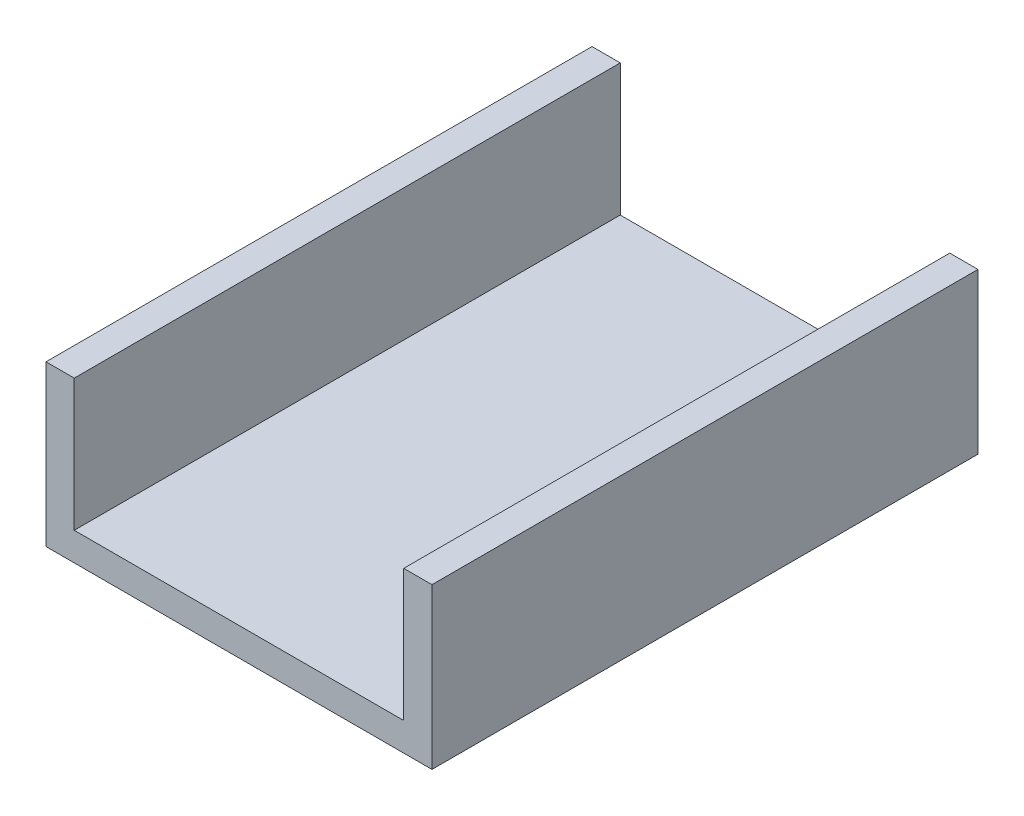
ISO-10303-21;
HEADER;
FILE_DESCRIPTION(('STEP AP214'),'2;1');
FILE_NAME('part.step','',(''),(''),'','','');
FILE_SCHEMA(('AUTOMOTIVE_DESIGN { 1 0 10303 214 1 1 1 1 }'));
ENDSEC;
DATA;
#1=APPLICATION_CONTEXT('core data for automotive mechanical design processes');
#2=APPLICATION_PROTOCOL_DEFINITION('international standard','automotive_design',2000,#1);
#3=PRODUCT_CONTEXT('',#1,'mechanical');
#4=PRODUCT('Part','Part','',(#3));
#5=PRODUCT_RELATED_PRODUCT_CATEGORY('part','',(#4));
#6=PRODUCT_DEFINITION_FORMATION('','',#4);
#7=PRODUCT_DEFINITION_CONTEXT('part definition',#1,'design');
#8=PRODUCT_DEFINITION('design','',#6,#7);
#9=PRODUCT_DEFINITION_SHAPE('','',#8);
#10=(LENGTH_UNIT() NAMED_UNIT(*) SI_UNIT(.MILLI.,.METRE.));
#11=(NAMED_UNIT(*) PLANE_ANGLE_UNIT() SI_UNIT($,.RADIAN.));
#12=(NAMED_UNIT(*) SI_UNIT($,.STERADIAN.) SOLID_ANGLE_UNIT());
#13=UNCERTAINTY_MEASURE_WITH_UNIT(LENGTH_MEASURE(1.E-05),#10,'distance_accuracy_value','');
#14=(GEOMETRIC_REPRESENTATION_CONTEXT(3) GLOBAL_UNCERTAINTY_ASSIGNED_CONTEXT((#13)) GLOBAL_UNIT_ASSIGNED_CONTEXT((#10,
#11,#12)) REPRESENTATION_CONTEXT('',''));
#15=CARTESIAN_POINT('',(0.,0.,0.));
#16=DIRECTION('',(0.,0.,1.));
#17=DIRECTION('',(1.,0.,0.));
#18=AXIS2_PLACEMENT_3D('',#15,#16,#17);
#19=CARTESIAN_POINT('',(0.,0.,580.));
#20=DIRECTION('',(-1.,0.,0.));
#21=DIRECTION('',(0.,0.,1.));
#22=AXIS2_PLACEMENT_3D('',#19,#20,#21);
#23=PLANE('',#22);
#24=DIRECTION('',(0.,1.,0.));
#25=VECTOR('',#24,1.);
#26=CARTESIAN_POINT('',(0.,0.,0.));
#27=LINE('',#26,#25);
#28=CARTESIAN_POINT('',(0.,30.,0.));
#29=VERTEX_POINT('',#28);
#30=CARTESIAN_POINT('',(0.,170.,0.));
#31=VERTEX_POINT('',#30);
#32=EDGE_CURVE('E132',#29,#31,#27,.T.);
#33=ORIENTED_EDGE('',*,*,#32,.T.);
#34=DIRECTION('',(0.,0.,-1.));
#35=VECTOR('',#34,1.);
#36=CARTESIAN_POINT('',(0.,170.,580.));
#37=LINE('',#36,#35);
#38=CARTESIAN_POINT('',(0.,170.,580.));
#39=VERTEX_POINT('',#38);
#40=EDGE_CURVE('E11',#39,#31,#37,.T.);
#41=ORIENTED_EDGE('',*,*,#40,.F.);
#42=DIRECTION('',(0.,1.,0.));
#43=VECTOR('',#42,1.);
#44=CARTESIAN_POINT('',(0.,0.,580.));
#45=LINE('',#44,#43);
#46=CARTESIAN_POINT('',(0.,30.,580.));
#47=VERTEX_POINT('',#46);
#48=EDGE_CURVE('E152',#47,#39,#45,.T.);
#49=ORIENTED_EDGE('',*,*,#48,.F.);
#50=DIRECTION('',(0.,0.,-1.));
#51=VECTOR('',#50,1.);
#52=CARTESIAN_POINT('',(0.,30.,580.));
#53=LINE('',#52,#51);
#54=EDGE_CURVE('E51',#47,#29,#53,.T.);
#55=ORIENTED_EDGE('',*,*,#54,.T.);
#56=EDGE_LOOP('',(#33,#41,#49,#55));
#57=FACE_BOUND('',#56,.T.);
#58=ADVANCED_FACE('F35',(#57),#23,.F.);
#59=CARTESIAN_POINT('',(-1.57281595155231E-13,170.,580.));
#60=DIRECTION('',(0.,-1.,0.));
#61=DIRECTION('',(1.,0.,0.));
#62=AXIS2_PLACEMENT_3D('',#59,#60,#61);
#63=PLANE('',#62);
#64=DIRECTION('',(-1.,0.,0.));
#65=VECTOR('',#64,1.);
#66=CARTESIAN_POINT('',(-1.57281595155231E-13,170.,0.));
#67=LINE('',#66,#65);
#68=CARTESIAN_POINT('',(-30.,170.,0.));
#69=VERTEX_POINT('',#68);
#70=EDGE_CURVE('E134',#31,#69,#67,.T.);
#71=ORIENTED_EDGE('',*,*,#70,.T.);
#72=DIRECTION('',(0.,0.,-1.));
#73=VECTOR('',#72,1.);
#74=CARTESIAN_POINT('',(-30.,170.,580.));
#75=LINE('',#74,#73);
#76=CARTESIAN_POINT('',(-30.,170.,580.));
#77=VERTEX_POINT('',#76);
#78=EDGE_CURVE('E43',#77,#69,#75,.T.);
#79=ORIENTED_EDGE('',*,*,#78,.F.);
#80=DIRECTION('',(-1.,0.,0.));
#81=VECTOR('',#80,1.);
#82=CARTESIAN_POINT('',(-1.57281595155231E-13,170.,580.));
#83=LINE('',#82,#81);
#84=EDGE_CURVE('E89',#39,#77,#83,.T.);
#85=ORIENTED_EDGE('',*,*,#84,.F.);
#86=ORIENTED_EDGE('',*,*,#40,.T.);
#87=EDGE_LOOP('',(#71,#79,#85,#86));
#88=FACE_BOUND('',#87,.T.);
#89=ADVANCED_FACE('F165',(#88),#63,.F.);
#90=CARTESIAN_POINT('',(-30.,0.,580.));
#91=DIRECTION('',(-1.,0.,0.));
#92=DIRECTION('',(0.,0.,1.));
#93=AXIS2_PLACEMENT_3D('',#90,#91,#92);
#94=PLANE('',#93);
#95=DIRECTION('',(0.,1.,0.));
#96=VECTOR('',#95,1.);
#97=CARTESIAN_POINT('',(-30.,0.,0.));
#98=LINE('',#97,#96);
#99=CARTESIAN_POINT('',(-30.,0.,0.));
#100=VERTEX_POINT('',#99);
#101=EDGE_CURVE('E137',#100,#69,#98,.T.);
#102=ORIENTED_EDGE('',*,*,#101,.F.);
#103=DIRECTION('',(0.,0.,-1.));
#104=VECTOR('',#103,1.);
#105=CARTESIAN_POINT('',(-30.,0.,580.));
#106=LINE('',#105,#104);
#107=CARTESIAN_POINT('',(-30.,0.,580.));
#108=VERTEX_POINT('',#107);
#109=EDGE_CURVE('E158',#108,#100,#106,.T.);
#110=ORIENTED_EDGE('',*,*,#109,.F.);
#111=DIRECTION('',(0.,1.,0.));
#112=VECTOR('',#111,1.);
#113=CARTESIAN_POINT('',(-30.,0.,580.));
#114=LINE('',#113,#112);
#115=EDGE_CURVE('E164',#108,#77,#114,.T.);
#116=ORIENTED_EDGE('',*,*,#115,.T.);
#117=ORIENTED_EDGE('',*,*,#78,.T.);
#118=EDGE_LOOP('',(#102,#110,#116,#117));
#119=FACE_BOUND('',#118,.T.);
#120=ADVANCED_FACE('F162',(#119),#94,.T.);
#121=CARTESIAN_POINT('',(0.,0.,580.));
#122=DIRECTION('',(0.,-1.,0.));
#123=DIRECTION('',(0.,0.,-1.));
#124=AXIS2_PLACEMENT_3D('',#121,#122,#123);
#125=PLANE('',#124);
#126=DIRECTION('',(-1.,0.,0.));
#127=VECTOR('',#126,1.);
#128=CARTESIAN_POINT('',(0.,0.,0.));
#129=LINE('',#128,#127);
#130=CARTESIAN_POINT('',(380.,0.,0.));
#131=VERTEX_POINT('',#130);
#132=EDGE_CURVE('E140',#131,#100,#129,.T.);
#133=ORIENTED_EDGE('',*,*,#132,.F.);
#134=DIRECTION('',(0.,0.,-1.));
#135=VECTOR('',#134,1.);
#136=CARTESIAN_POINT('',(380.,0.,580.));
#137=LINE('',#136,#135);
#138=CARTESIAN_POINT('',(380.,0.,580.));
#139=VERTEX_POINT('',#138);
#140=EDGE_CURVE('E156',#139,#131,#137,.T.);
#141=ORIENTED_EDGE('',*,*,#140,.F.);
#142=DIRECTION('',(-1.,0.,0.));
#143=VECTOR('',#142,1.);
#144=CARTESIAN_POINT('',(0.,0.,580.));
#145=LINE('',#144,#143);
#146=EDGE_CURVE('E174',#139,#108,#145,.T.);
#147=ORIENTED_EDGE('',*,*,#146,.T.);
#148=ORIENTED_EDGE('',*,*,#109,.T.);
#149=EDGE_LOOP('',(#133,#141,#147,#148));
#150=FACE_BOUND('',#149,.T.);
#151=ADVANCED_FACE('F172',(#150),#125,.T.);
#152=CARTESIAN_POINT('',(380.,0.,580.));
#153=DIRECTION('',(-1.,0.,0.));
#154=DIRECTION('',(0.,0.,1.));
#155=AXIS2_PLACEMENT_3D('',#152,#153,#154);
#156=PLANE('',#155);
#157=DIRECTION('',(0.,1.,0.));
#158=VECTOR('',#157,1.);
#159=CARTESIAN_POINT('',(380.,0.,0.));
#160=LINE('',#159,#158);
#161=CARTESIAN_POINT('',(380.,170.,0.));
#162=VERTEX_POINT('',#161);
#163=EDGE_CURVE('E143',#131,#162,#160,.T.);
#164=ORIENTED_EDGE('',*,*,#163,.T.);
#165=DIRECTION('',(0.,0.,-1.));
#166=VECTOR('',#165,1.);
#167=CARTESIAN_POINT('',(380.,170.,580.));
#168=LINE('',#167,#166);
#169=CARTESIAN_POINT('',(380.,170.,580.));
#170=VERTEX_POINT('',#169);
#171=EDGE_CURVE('E114',#170,#162,#168,.T.);
#172=ORIENTED_EDGE('',*,*,#171,.F.);
#173=DIRECTION('',(0.,1.,0.));
#174=VECTOR('',#173,1.);
#175=CARTESIAN_POINT('',(380.,0.,580.));
#176=LINE('',#175,#174);
#177=EDGE_CURVE('E123',#139,#170,#176,.T.);
#178=ORIENTED_EDGE('',*,*,#177,.F.);
#179=ORIENTED_EDGE('',*,*,#140,.T.);
#180=EDGE_LOOP('',(#164,#172,#178,#179));
#181=FACE_BOUND('',#180,.T.);
#182=ADVANCED_FACE('F200',(#181),#156,.F.);
#183=CARTESIAN_POINT('',(0.,170.,580.));
#184=DIRECTION('',(0.,1.,0.));
#185=DIRECTION('',(0.,0.,1.));
#186=AXIS2_PLACEMENT_3D('',#183,#184,#185);
#187=PLANE('',#186);
#188=DIRECTION('',(1.,0.,0.));
#189=VECTOR('',#188,1.);
#190=CARTESIAN_POINT('',(0.,170.,0.));
#191=LINE('',#190,#189);
#192=CARTESIAN_POINT('',(350.,170.,0.));
#193=VERTEX_POINT('',#192);
#194=EDGE_CURVE('E110',#193,#162,#191,.T.);
#195=ORIENTED_EDGE('',*,*,#194,.F.);
#196=DIRECTION('',(0.,0.,-1.));
#197=VECTOR('',#196,1.);
#198=CARTESIAN_POINT('',(350.,170.,580.));
#199=LINE('',#198,#197);
#200=CARTESIAN_POINT('',(350.,170.,580.));
#201=VERTEX_POINT('',#200);
#202=EDGE_CURVE('E105',#201,#193,#199,.T.);
#203=ORIENTED_EDGE('',*,*,#202,.F.);
#204=DIRECTION('',(1.,0.,0.));
#205=VECTOR('',#204,1.);
#206=CARTESIAN_POINT('',(0.,170.,580.));
#207=LINE('',#206,#205);
#208=EDGE_CURVE('E108',#201,#170,#207,.T.);
#209=ORIENTED_EDGE('',*,*,#208,.T.);
#210=ORIENTED_EDGE('',*,*,#171,.T.);
#211=EDGE_LOOP('',(#195,#203,#209,#210));
#212=FACE_BOUND('',#211,.T.);
#213=ADVANCED_FACE('F107',(#212),#187,.T.);
#214=CARTESIAN_POINT('',(350.,0.,580.));
#215=DIRECTION('',(-1.,0.,0.));
#216=DIRECTION('',(0.,0.,1.));
#217=AXIS2_PLACEMENT_3D('',#214,#215,#216);
#218=PLANE('',#217);
#219=DIRECTION('',(0.,1.,0.));
#220=VECTOR('',#219,1.);
#221=CARTESIAN_POINT('',(350.,0.,0.));
#222=LINE('',#221,#220);
#223=CARTESIAN_POINT('',(350.,30.,0.));
#224=VERTEX_POINT('',#223);
#225=EDGE_CURVE('E147',#224,#193,#222,.T.);
#226=ORIENTED_EDGE('',*,*,#225,.F.);
#227=DIRECTION('',(0.,0.,-1.));
#228=VECTOR('',#227,1.);
#229=CARTESIAN_POINT('',(350.,30.,580.));
#230=LINE('',#229,#228);
#231=CARTESIAN_POINT('',(350.,30.,580.));
#232=VERTEX_POINT('',#231);
#233=EDGE_CURVE('E77',#232,#224,#230,.T.);
#234=ORIENTED_EDGE('',*,*,#233,.F.);
#235=DIRECTION('',(0.,1.,0.));
#236=VECTOR('',#235,1.);
#237=CARTESIAN_POINT('',(350.,0.,580.));
#238=LINE('',#237,#236);
#239=EDGE_CURVE('E120',#232,#201,#238,.T.);
#240=ORIENTED_EDGE('',*,*,#239,.T.);
#241=ORIENTED_EDGE('',*,*,#202,.T.);
#242=EDGE_LOOP('',(#226,#234,#240,#241));
#243=FACE_BOUND('',#242,.T.);
#244=ADVANCED_FACE('F126',(#243),#218,.T.);
#245=CARTESIAN_POINT('',(0.,30.,580.));
#246=DIRECTION('',(0.,1.,0.));
#247=DIRECTION('',(0.,0.,1.));
#248=AXIS2_PLACEMENT_3D('',#245,#246,#247);
#249=PLANE('',#248);
#250=DIRECTION('',(1.,0.,0.));
#251=VECTOR('',#250,1.);
#252=CARTESIAN_POINT('',(0.,30.,0.));
#253=LINE('',#252,#251);
#254=EDGE_CURVE('E149',#29,#224,#253,.T.);
#255=ORIENTED_EDGE('',*,*,#254,.F.);
#256=ORIENTED_EDGE('',*,*,#54,.F.);
#257=DIRECTION('',(1.,0.,0.));
#258=VECTOR('',#257,1.);
#259=CARTESIAN_POINT('',(0.,30.,580.));
#260=LINE('',#259,#258);
#261=EDGE_CURVE('E127',#47,#232,#260,.T.);
#262=ORIENTED_EDGE('',*,*,#261,.T.);
#263=ORIENTED_EDGE('',*,*,#233,.T.);
#264=EDGE_LOOP('',(#255,#256,#262,#263));
#265=FACE_BOUND('',#264,.T.);
#266=ADVANCED_FACE('F179',(#265),#249,.T.);
#267=CARTESIAN_POINT('',(0.,0.,580.));
#268=DIRECTION('',(0.,0.,1.));
#269=DIRECTION('',(1.,0.,0.));
#270=AXIS2_PLACEMENT_3D('',#267,#268,#269);
#271=PLANE('',#270);
#272=ORIENTED_EDGE('',*,*,#48,.T.);
#273=ORIENTED_EDGE('',*,*,#84,.T.);
#274=ORIENTED_EDGE('',*,*,#115,.F.);
#275=ORIENTED_EDGE('',*,*,#146,.F.);
#276=ORIENTED_EDGE('',*,*,#177,.T.);
#277=ORIENTED_EDGE('',*,*,#208,.F.);
#278=ORIENTED_EDGE('',*,*,#239,.F.);
#279=ORIENTED_EDGE('',*,*,#261,.F.);
#280=EDGE_LOOP('',(#272,#273,#274,#275,#276,#277,#278,#279));
#281=FACE_BOUND('',#280,.T.);
#282=ADVANCED_FACE('F118',(#281),#271,.T.);
#283=CARTESIAN_POINT('',(0.,0.,0.));
#284=DIRECTION('',(0.,0.,1.));
#285=DIRECTION('',(1.,0.,0.));
#286=AXIS2_PLACEMENT_3D('',#283,#284,#285);
#287=PLANE('',#286);
#288=ORIENTED_EDGE('',*,*,#32,.F.);
#289=ORIENTED_EDGE('',*,*,#254,.T.);
#290=ORIENTED_EDGE('',*,*,#225,.T.);
#291=ORIENTED_EDGE('',*,*,#194,.T.);
#292=ORIENTED_EDGE('',*,*,#163,.F.);
#293=ORIENTED_EDGE('',*,*,#132,.T.);
#294=ORIENTED_EDGE('',*,*,#101,.T.);
#295=ORIENTED_EDGE('',*,*,#70,.F.);
#296=EDGE_LOOP('',(#288,#289,#290,#291,#292,#293,#294,#295));
#297=FACE_BOUND('',#296,.T.);
#298=ADVANCED_FACE('F168',(#297),#287,.F.);
#299=CLOSED_SHELL('',(#58,#89,#120,#151,#182,#213,#244,#266,#282,#298));
#300=MANIFOLD_SOLID_BREP('B2',#299);
#301=ADVANCED_BREP_SHAPE_REPRESENTATION('',(#18,#300),#14);
#302=SHAPE_DEFINITION_REPRESENTATION(#9,#301);
ENDSEC;
END-ISO-10303-21;
